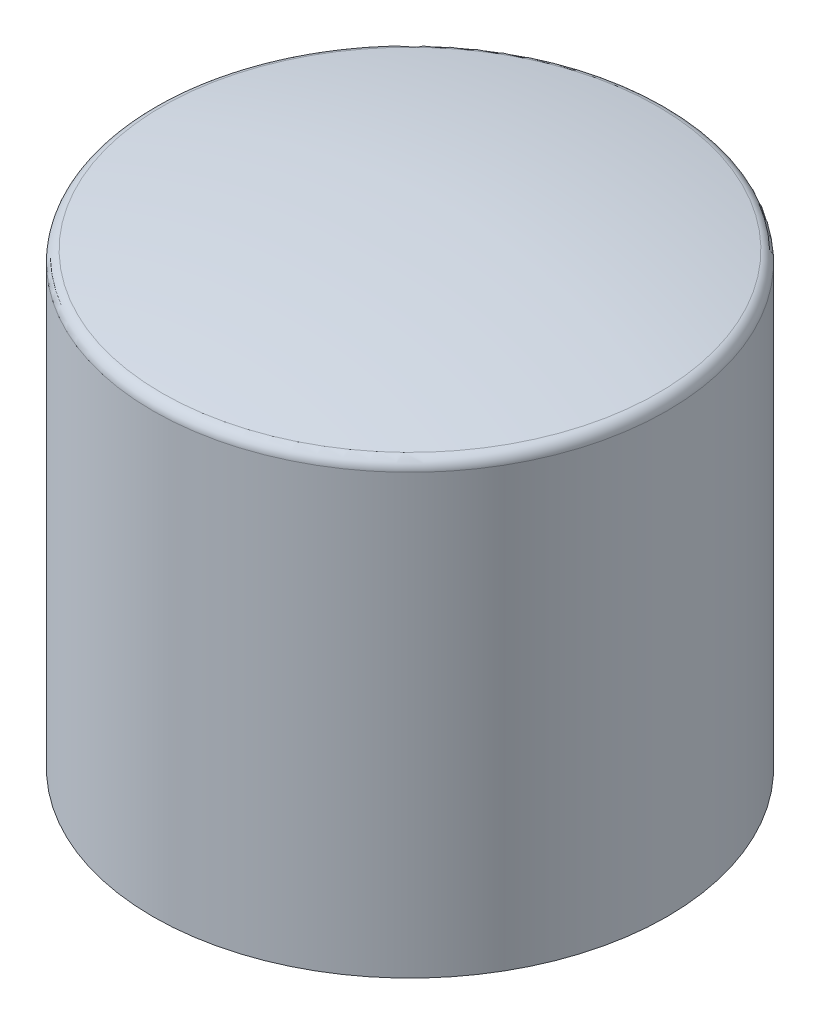
ISO-10303-21;
HEADER;
FILE_DESCRIPTION(('STEP AP214'),'2;1');
FILE_NAME('part.step','',(''),(''),'','','');
FILE_SCHEMA(('AUTOMOTIVE_DESIGN { 1 0 10303 214 1 1 1 1 }'));
ENDSEC;
DATA;
#1=APPLICATION_CONTEXT('core data for automotive mechanical design processes');
#2=APPLICATION_PROTOCOL_DEFINITION('international standard','automotive_design',2000,#1);
#3=PRODUCT_CONTEXT('',#1,'mechanical');
#4=PRODUCT('Part','Part','',(#3));
#5=PRODUCT_RELATED_PRODUCT_CATEGORY('part','',(#4));
#6=PRODUCT_DEFINITION_FORMATION('','',#4);
#7=PRODUCT_DEFINITION_CONTEXT('part definition',#1,'design');
#8=PRODUCT_DEFINITION('design','',#6,#7);
#9=PRODUCT_DEFINITION_SHAPE('','',#8);
#10=(LENGTH_UNIT() NAMED_UNIT(*) SI_UNIT(.MILLI.,.METRE.));
#11=(NAMED_UNIT(*) PLANE_ANGLE_UNIT() SI_UNIT($,.RADIAN.));
#12=(NAMED_UNIT(*) SI_UNIT($,.STERADIAN.) SOLID_ANGLE_UNIT());
#13=UNCERTAINTY_MEASURE_WITH_UNIT(LENGTH_MEASURE(1.E-05),#10,'distance_accuracy_value','');
#14=(GEOMETRIC_REPRESENTATION_CONTEXT(3) GLOBAL_UNCERTAINTY_ASSIGNED_CONTEXT((#13)) GLOBAL_UNIT_ASSIGNED_CONTEXT((#10,
#11,#12)) REPRESENTATION_CONTEXT('',''));
#15=CARTESIAN_POINT('',(0.,0.,0.));
#16=DIRECTION('',(0.,0.,1.));
#17=DIRECTION('',(1.,0.,0.));
#18=AXIS2_PLACEMENT_3D('',#15,#16,#17);
#19=CARTESIAN_POINT('',(0.,-1.16979984071467,-11.5));
#20=CARTESIAN_POINT('',(0.,0.0240803516046566,-5.8091545660612));
#21=CARTESIAN_POINT('',(0.,0.,0.));
#22=B_SPLINE_CURVE_WITH_KNOTS('',2,(#19,#20,#21),.UNSPECIFIED.,.F.,.F.,(3,3),(0.,1.),.UNSPECIFIED.);
#23=CARTESIAN_POINT('',(0.,-21.1697998407147,0.));
#24=DIRECTION('',(0.,-1.,0.));
#25=AXIS1_PLACEMENT('',#23,#24);
#26=SURFACE_OF_REVOLUTION('',#22,#25);
#27=CARTESIAN_POINT('',(0.,-1.08722580516711,0.));
#28=DIRECTION('',(0.,-1.,0.));
#29=DIRECTION('',(0.,0.,-1.));
#30=AXIS2_PLACEMENT_3D('',#27,#28,#29);
#31=CIRCLE('',#30,11.0990498029392);
#32=CARTESIAN_POINT('',(0.,-1.08722580516711,-11.0990498029392));
#33=VERTEX_POINT('',#32);
#34=EDGE_CURVE('E11',#33,#33,#31,.F.);
#35=ORIENTED_EDGE('',*,*,#34,.T.);
#36=EDGE_LOOP('',(#35));
#37=FACE_BOUND('',#36,.T.);
#38=CARTESIAN_POINT('',(0.,0.,0.));
#39=VERTEX_POINT('',#38);
#40=VERTEX_LOOP('',#39);
#41=FACE_BOUND('',#40,.T.);
#42=ADVANCED_FACE('F35',(#37,#41),#26,.F.);
#43=CARTESIAN_POINT('',(0.,-21.1697998407147,-11.5));
#44=DIRECTION('',(0.,-1.,0.));
#45=DIRECTION('',(0.,0.,-1.));
#46=AXIS2_PLACEMENT_3D('',#43,#44,#45);
#47=PLANE('',#46);
#48=CARTESIAN_POINT('',(0.,-21.1697998407147,0.));
#49=DIRECTION('',(0.,-1.,0.));
#50=DIRECTION('',(0.,0.,-1.));
#51=AXIS2_PLACEMENT_3D('',#48,#49,#50);
#52=CIRCLE('',#51,11.5);
#53=CARTESIAN_POINT('',(0.,-21.1697998407147,-11.5));
#54=VERTEX_POINT('',#53);
#55=EDGE_CURVE('E60',#54,#54,#52,.T.);
#56=ORIENTED_EDGE('',*,*,#55,.T.);
#57=EDGE_LOOP('',(#56));
#58=FACE_BOUND('',#57,.T.);
#59=ADVANCED_FACE('F46',(#58),#47,.T.);
#60=CARTESIAN_POINT('',(0.,-21.1697998407147,0.));
#61=DIRECTION('',(0.,-1.,0.));
#62=DIRECTION('',(0.,0.,-1.));
#63=AXIS2_PLACEMENT_3D('',#60,#61,#62);
#64=CYLINDRICAL_SURFACE('',#63,11.5);
#65=CARTESIAN_POINT('',(0.,-1.57731675237764,0.));
#66=DIRECTION('',(0.,1.,0.));
#67=DIRECTION('',(0.,0.,1.));
#68=AXIS2_PLACEMENT_3D('',#65,#66,#67);
#69=CIRCLE('',#68,11.5);
#70=CARTESIAN_POINT('',(0.,-1.57731675237764,11.5));
#71=VERTEX_POINT('',#70);
#72=EDGE_CURVE('E42',#71,#71,#69,.F.);
#73=ORIENTED_EDGE('',*,*,#72,.T.);
#74=EDGE_LOOP('',(#73));
#75=FACE_BOUND('',#74,.T.);
#76=ORIENTED_EDGE('',*,*,#55,.F.);
#77=EDGE_LOOP('',(#76));
#78=FACE_BOUND('',#77,.T.);
#79=ADVANCED_FACE('F51',(#75,#78),#64,.T.);
#80=CARTESIAN_POINT('',(0.,-1.57731675237764,0.));
#81=DIRECTION('',(0.,1.,0.));
#82=DIRECTION('',(0.,0.,1.));
#83=AXIS2_PLACEMENT_3D('',#80,#81,#82);
#84=TOROIDAL_SURFACE('',#83,11.,0.5);
#85=ORIENTED_EDGE('',*,*,#34,.F.);
#86=EDGE_LOOP('',(#85));
#87=FACE_BOUND('',#86,.T.);
#88=ORIENTED_EDGE('',*,*,#72,.F.);
#89=EDGE_LOOP('',(#88));
#90=FACE_BOUND('',#89,.T.);
#91=ADVANCED_FACE('F37',(#87,#90),#84,.T.);
#92=CLOSED_SHELL('',(#42,#59,#79,#91));
#93=MANIFOLD_SOLID_BREP('B2',#92);
#94=ADVANCED_BREP_SHAPE_REPRESENTATION('',(#18,#93),#14);
#95=SHAPE_DEFINITION_REPRESENTATION(#9,#94);
ENDSEC;
END-ISO-10303-21;
